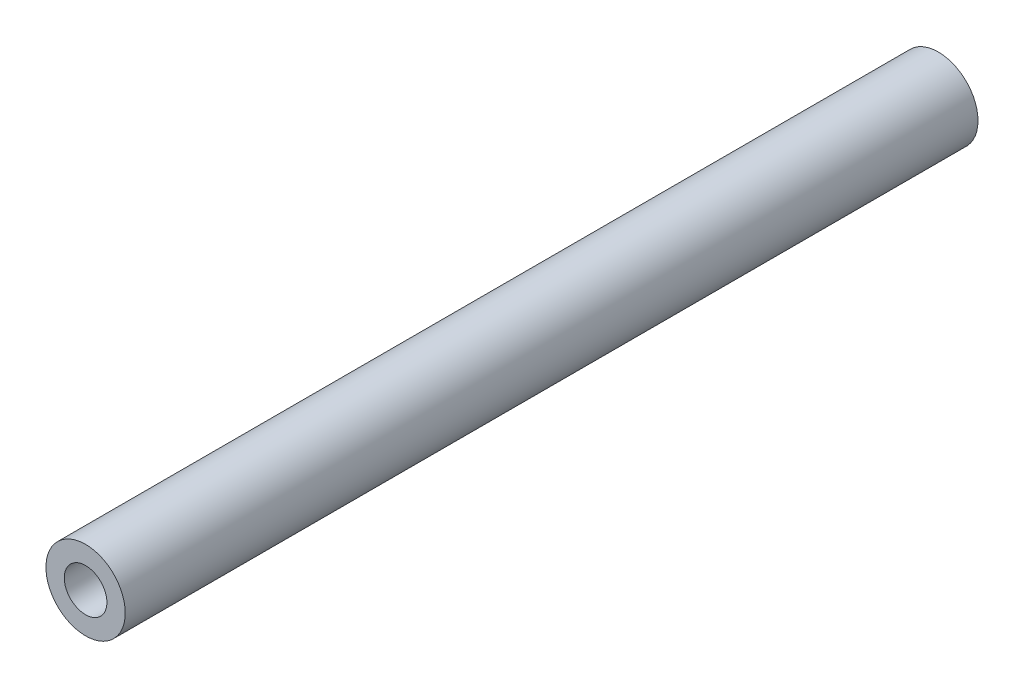
ISO-10303-21;
HEADER;
FILE_DESCRIPTION(('STEP AP214'),'2;1');
FILE_NAME('part.step','',(''),(''),'','','');
FILE_SCHEMA(('AUTOMOTIVE_DESIGN { 1 0 10303 214 1 1 1 1 }'));
ENDSEC;
DATA;
#1=APPLICATION_CONTEXT('core data for automotive mechanical design processes');
#2=APPLICATION_PROTOCOL_DEFINITION('international standard','automotive_design',2000,#1);
#3=PRODUCT_CONTEXT('',#1,'mechanical');
#4=PRODUCT('Part','Part','',(#3));
#5=PRODUCT_RELATED_PRODUCT_CATEGORY('part','',(#4));
#6=PRODUCT_DEFINITION_FORMATION('','',#4);
#7=PRODUCT_DEFINITION_CONTEXT('part definition',#1,'design');
#8=PRODUCT_DEFINITION('design','',#6,#7);
#9=PRODUCT_DEFINITION_SHAPE('','',#8);
#10=(LENGTH_UNIT() NAMED_UNIT(*) SI_UNIT(.MILLI.,.METRE.));
#11=(NAMED_UNIT(*) PLANE_ANGLE_UNIT() SI_UNIT($,.RADIAN.));
#12=(NAMED_UNIT(*) SI_UNIT($,.STERADIAN.) SOLID_ANGLE_UNIT());
#13=UNCERTAINTY_MEASURE_WITH_UNIT(LENGTH_MEASURE(1.E-05),#10,'distance_accuracy_value','');
#14=(GEOMETRIC_REPRESENTATION_CONTEXT(3) GLOBAL_UNCERTAINTY_ASSIGNED_CONTEXT((#13)) GLOBAL_UNIT_ASSIGNED_CONTEXT((#10,
#11,#12)) REPRESENTATION_CONTEXT('',''));
#15=CARTESIAN_POINT('',(0.,0.,0.));
#16=DIRECTION('',(0.,0.,1.));
#17=DIRECTION('',(1.,0.,0.));
#18=AXIS2_PLACEMENT_3D('',#15,#16,#17);
#19=CARTESIAN_POINT('',(0.,0.,50.8));
#20=DIRECTION('',(0.,0.,1.));
#21=DIRECTION('',(1.,0.,0.));
#22=AXIS2_PLACEMENT_3D('',#19,#20,#21);
#23=PLANE('',#22);
#24=CARTESIAN_POINT('',(0.,0.,50.8));
#25=DIRECTION('',(0.,0.,1.));
#26=DIRECTION('',(1.,0.,0.));
#27=AXIS2_PLACEMENT_3D('',#24,#25,#26);
#28=CIRCLE('',#27,2.3622);
#29=CARTESIAN_POINT('',(2.3622,0.,50.8));
#30=VERTEX_POINT('',#29);
#31=EDGE_CURVE('E10',#30,#30,#28,.T.);
#32=ORIENTED_EDGE('',*,*,#31,.T.);
#33=EDGE_LOOP('',(#32));
#34=FACE_BOUND('',#33,.T.);
#35=CARTESIAN_POINT('',(0.,0.,50.8));
#36=DIRECTION('',(0.,0.,1.));
#37=DIRECTION('',(1.,0.,0.));
#38=AXIS2_PLACEMENT_3D('',#35,#36,#37);
#39=CIRCLE('',#38,1.27);
#40=CARTESIAN_POINT('',(1.27,0.,50.8));
#41=VERTEX_POINT('',#40);
#42=EDGE_CURVE('E43',#41,#41,#39,.T.);
#43=ORIENTED_EDGE('',*,*,#42,.F.);
#44=EDGE_LOOP('',(#43));
#45=FACE_BOUND('',#44,.T.);
#46=ADVANCED_FACE('F32',(#34,#45),#23,.T.);
#47=CARTESIAN_POINT('',(0.,0.,0.));
#48=DIRECTION('',(0.,0.,1.));
#49=DIRECTION('',(1.,0.,0.));
#50=AXIS2_PLACEMENT_3D('',#47,#48,#49);
#51=PLANE('',#50);
#52=CARTESIAN_POINT('',(0.,0.,0.));
#53=DIRECTION('',(0.,0.,1.));
#54=DIRECTION('',(1.,0.,0.));
#55=AXIS2_PLACEMENT_3D('',#52,#53,#54);
#56=CIRCLE('',#55,2.3622);
#57=CARTESIAN_POINT('',(2.3622,0.,0.));
#58=VERTEX_POINT('',#57);
#59=EDGE_CURVE('E36',#58,#58,#56,.T.);
#60=ORIENTED_EDGE('',*,*,#59,.F.);
#61=EDGE_LOOP('',(#60));
#62=FACE_BOUND('',#61,.T.);
#63=CARTESIAN_POINT('',(0.,0.,0.));
#64=DIRECTION('',(0.,0.,1.));
#65=DIRECTION('',(1.,0.,0.));
#66=AXIS2_PLACEMENT_3D('',#63,#64,#65);
#67=CIRCLE('',#66,1.27);
#68=CARTESIAN_POINT('',(1.27,0.,0.));
#69=VERTEX_POINT('',#68);
#70=EDGE_CURVE('E45',#69,#69,#67,.T.);
#71=ORIENTED_EDGE('',*,*,#70,.T.);
#72=EDGE_LOOP('',(#71));
#73=FACE_BOUND('',#72,.T.);
#74=ADVANCED_FACE('F55',(#62,#73),#51,.F.);
#75=CARTESIAN_POINT('',(0.,0.,50.8));
#76=DIRECTION('',(0.,0.,-1.));
#77=DIRECTION('',(-1.,0.,0.));
#78=AXIS2_PLACEMENT_3D('',#75,#76,#77);
#79=CYLINDRICAL_SURFACE('',#78,2.3622);
#80=ORIENTED_EDGE('',*,*,#31,.F.);
#81=EDGE_LOOP('',(#80));
#82=FACE_BOUND('',#81,.T.);
#83=ORIENTED_EDGE('',*,*,#59,.T.);
#84=EDGE_LOOP('',(#83));
#85=FACE_BOUND('',#84,.T.);
#86=ADVANCED_FACE('F34',(#82,#85),#79,.T.);
#87=CARTESIAN_POINT('',(0.,0.,50.8));
#88=DIRECTION('',(0.,0.,-1.));
#89=DIRECTION('',(-1.,0.,0.));
#90=AXIS2_PLACEMENT_3D('',#87,#88,#89);
#91=CYLINDRICAL_SURFACE('',#90,1.27);
#92=ORIENTED_EDGE('',*,*,#42,.T.);
#93=EDGE_LOOP('',(#92));
#94=FACE_BOUND('',#93,.T.);
#95=ORIENTED_EDGE('',*,*,#70,.F.);
#96=EDGE_LOOP('',(#95));
#97=FACE_BOUND('',#96,.T.);
#98=ADVANCED_FACE('F51',(#94,#97),#91,.F.);
#99=CLOSED_SHELL('',(#46,#74,#86,#98));
#100=MANIFOLD_SOLID_BREP('B2',#99);
#101=ADVANCED_BREP_SHAPE_REPRESENTATION('',(#18,#100),#14);
#102=SHAPE_DEFINITION_REPRESENTATION(#9,#101);
ENDSEC;
END-ISO-10303-21;
